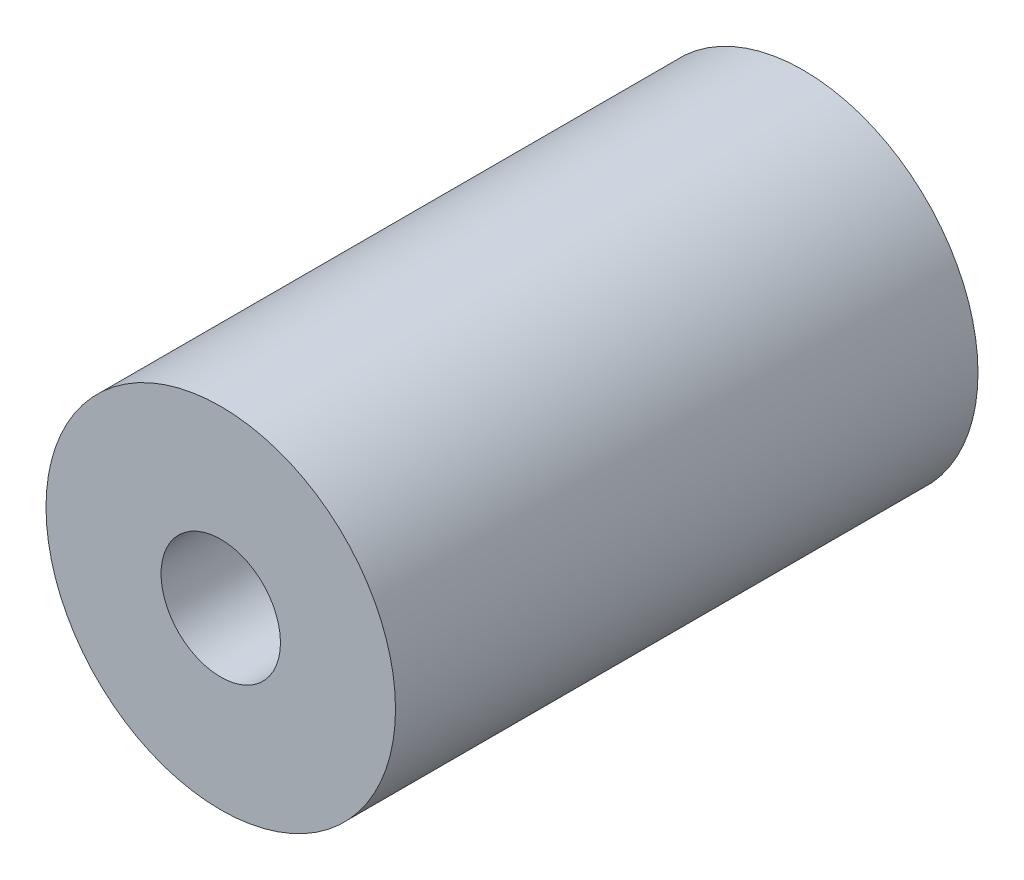
ISO-10303-21;
HEADER;
FILE_DESCRIPTION(('STEP AP214'),'2;1');
FILE_NAME('part.step','',(''),(''),'','','');
FILE_SCHEMA(('AUTOMOTIVE_DESIGN { 1 0 10303 214 1 1 1 1 }'));
ENDSEC;
DATA;
#1=APPLICATION_CONTEXT('core data for automotive mechanical design processes');
#2=APPLICATION_PROTOCOL_DEFINITION('international standard','automotive_design',2000,#1);
#3=PRODUCT_CONTEXT('',#1,'mechanical');
#4=PRODUCT('Part','Part','',(#3));
#5=PRODUCT_RELATED_PRODUCT_CATEGORY('part','',(#4));
#6=PRODUCT_DEFINITION_FORMATION('','',#4);
#7=PRODUCT_DEFINITION_CONTEXT('part definition',#1,'design');
#8=PRODUCT_DEFINITION('design','',#6,#7);
#9=PRODUCT_DEFINITION_SHAPE('','',#8);
#10=(LENGTH_UNIT() NAMED_UNIT(*) SI_UNIT(.MILLI.,.METRE.));
#11=(NAMED_UNIT(*) PLANE_ANGLE_UNIT() SI_UNIT($,.RADIAN.));
#12=(NAMED_UNIT(*) SI_UNIT($,.STERADIAN.) SOLID_ANGLE_UNIT());
#13=UNCERTAINTY_MEASURE_WITH_UNIT(LENGTH_MEASURE(1.E-05),#10,'distance_accuracy_value','');
#14=(GEOMETRIC_REPRESENTATION_CONTEXT(3) GLOBAL_UNCERTAINTY_ASSIGNED_CONTEXT((#13)) GLOBAL_UNIT_ASSIGNED_CONTEXT((#10,
#11,#12)) REPRESENTATION_CONTEXT('',''));
#15=CARTESIAN_POINT('',(0.,0.,0.));
#16=DIRECTION('',(0.,0.,1.));
#17=DIRECTION('',(1.,0.,0.));
#18=AXIS2_PLACEMENT_3D('',#15,#16,#17);
#19=CARTESIAN_POINT('',(0.,0.,10.));
#20=DIRECTION('',(0.,0.,-1.));
#21=DIRECTION('',(-1.,0.,0.));
#22=AXIS2_PLACEMENT_3D('',#19,#20,#21);
#23=CYLINDRICAL_SURFACE('',#22,3.);
#24=CARTESIAN_POINT('',(0.,0.,10.));
#25=DIRECTION('',(0.,0.,1.));
#26=DIRECTION('',(1.,0.,0.));
#27=AXIS2_PLACEMENT_3D('',#24,#25,#26);
#28=CIRCLE('',#27,3.);
#29=CARTESIAN_POINT('',(3.,0.,10.));
#30=VERTEX_POINT('',#29);
#31=EDGE_CURVE('E10',#30,#30,#28,.T.);
#32=ORIENTED_EDGE('',*,*,#31,.F.);
#33=EDGE_LOOP('',(#32));
#34=FACE_BOUND('',#33,.T.);
#35=CARTESIAN_POINT('',(0.,0.,0.));
#36=DIRECTION('',(0.,0.,1.));
#37=DIRECTION('',(1.,0.,0.));
#38=AXIS2_PLACEMENT_3D('',#35,#36,#37);
#39=CIRCLE('',#38,3.);
#40=CARTESIAN_POINT('',(3.,0.,0.));
#41=VERTEX_POINT('',#40);
#42=EDGE_CURVE('E44',#41,#41,#39,.T.);
#43=ORIENTED_EDGE('',*,*,#42,.T.);
#44=EDGE_LOOP('',(#43));
#45=FACE_BOUND('',#44,.T.);
#46=ADVANCED_FACE('F41',(#34,#45),#23,.T.);
#47=CARTESIAN_POINT('',(0.,0.,10.));
#48=DIRECTION('',(0.,0.,1.));
#49=DIRECTION('',(1.,0.,0.));
#50=AXIS2_PLACEMENT_3D('',#47,#48,#49);
#51=PLANE('',#50);
#52=CARTESIAN_POINT('',(0.,0.,10.));
#53=DIRECTION('',(0.,0.,1.));
#54=DIRECTION('',(1.,0.,0.));
#55=AXIS2_PLACEMENT_3D('',#52,#53,#54);
#56=CIRCLE('',#55,1.025);
#57=CARTESIAN_POINT('',(1.025,0.,10.));
#58=VERTEX_POINT('',#57);
#59=EDGE_CURVE('E58',#58,#58,#56,.T.);
#60=ORIENTED_EDGE('',*,*,#59,.F.);
#61=EDGE_LOOP('',(#60));
#62=FACE_BOUND('',#61,.T.);
#63=ORIENTED_EDGE('',*,*,#31,.T.);
#64=EDGE_LOOP('',(#63));
#65=FACE_BOUND('',#64,.T.);
#66=ADVANCED_FACE('F65',(#62,#65),#51,.T.);
#67=CARTESIAN_POINT('',(0.,0.,0.));
#68=DIRECTION('',(0.,0.,1.));
#69=DIRECTION('',(1.,0.,0.));
#70=AXIS2_PLACEMENT_3D('',#67,#68,#69);
#71=PLANE('',#70);
#72=CARTESIAN_POINT('',(0.,0.,0.));
#73=DIRECTION('',(0.,0.,1.));
#74=DIRECTION('',(1.,0.,0.));
#75=AXIS2_PLACEMENT_3D('',#72,#73,#74);
#76=CIRCLE('',#75,1.025);
#77=CARTESIAN_POINT('',(1.025,0.,0.));
#78=VERTEX_POINT('',#77);
#79=EDGE_CURVE('E53',#78,#78,#76,.T.);
#80=ORIENTED_EDGE('',*,*,#79,.T.);
#81=EDGE_LOOP('',(#80));
#82=FACE_BOUND('',#81,.T.);
#83=ORIENTED_EDGE('',*,*,#42,.F.);
#84=EDGE_LOOP('',(#83));
#85=FACE_BOUND('',#84,.T.);
#86=ADVANCED_FACE('F67',(#82,#85),#71,.F.);
#87=CARTESIAN_POINT('',(0.,0.,10.));
#88=DIRECTION('',(0.,0.,1.));
#89=DIRECTION('',(1.,0.,0.));
#90=AXIS2_PLACEMENT_3D('',#87,#88,#89);
#91=CYLINDRICAL_SURFACE('',#90,1.025);
#92=ORIENTED_EDGE('',*,*,#79,.F.);
#93=EDGE_LOOP('',(#92));
#94=FACE_BOUND('',#93,.T.);
#95=ORIENTED_EDGE('',*,*,#59,.T.);
#96=EDGE_LOOP('',(#95));
#97=FACE_BOUND('',#96,.T.);
#98=ADVANCED_FACE('F63',(#94,#97),#91,.F.);
#99=CLOSED_SHELL('',(#46,#66,#86,#98));
#100=MANIFOLD_SOLID_BREP('B2',#99);
#101=ADVANCED_BREP_SHAPE_REPRESENTATION('',(#18,#100),#14);
#102=SHAPE_DEFINITION_REPRESENTATION(#9,#101);
ENDSEC;
END-ISO-10303-21;
